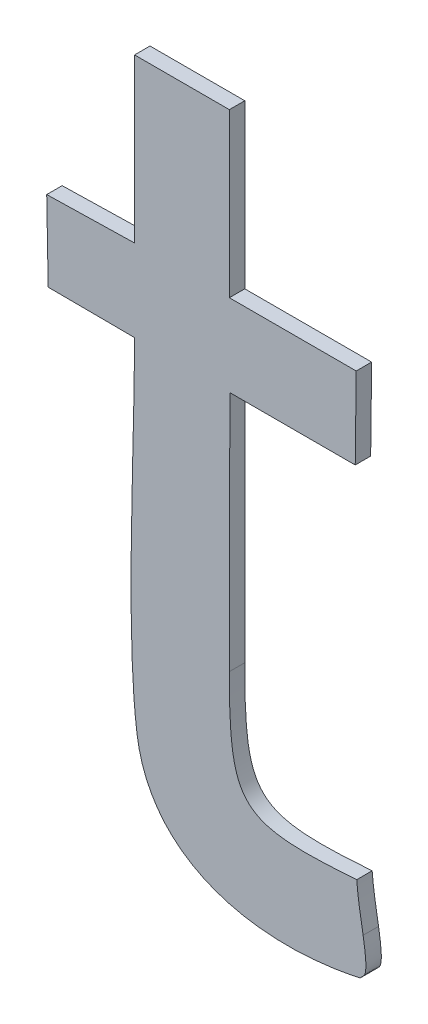
ISO-10303-21;
HEADER;
FILE_DESCRIPTION(('STEP AP214'),'2;1');
FILE_NAME('part.step','',(''),(''),'','','');
FILE_SCHEMA(('AUTOMOTIVE_DESIGN { 1 0 10303 214 1 1 1 1 }'));
ENDSEC;
DATA;
#1=APPLICATION_CONTEXT('core data for automotive mechanical design processes');
#2=APPLICATION_PROTOCOL_DEFINITION('international standard','automotive_design',2000,#1);
#3=PRODUCT_CONTEXT('',#1,'mechanical');
#4=PRODUCT('Part','Part','',(#3));
#5=PRODUCT_RELATED_PRODUCT_CATEGORY('part','',(#4));
#6=PRODUCT_DEFINITION_FORMATION('','',#4);
#7=PRODUCT_DEFINITION_CONTEXT('part definition',#1,'design');
#8=PRODUCT_DEFINITION('design','',#6,#7);
#9=PRODUCT_DEFINITION_SHAPE('','',#8);
#10=(LENGTH_UNIT() NAMED_UNIT(*) SI_UNIT(.MILLI.,.METRE.));
#11=(NAMED_UNIT(*) PLANE_ANGLE_UNIT() SI_UNIT($,.RADIAN.));
#12=(NAMED_UNIT(*) SI_UNIT($,.STERADIAN.) SOLID_ANGLE_UNIT());
#13=UNCERTAINTY_MEASURE_WITH_UNIT(LENGTH_MEASURE(1.E-05),#10,'distance_accuracy_value','');
#14=(GEOMETRIC_REPRESENTATION_CONTEXT(3) GLOBAL_UNCERTAINTY_ASSIGNED_CONTEXT((#13)) GLOBAL_UNIT_ASSIGNED_CONTEXT((#10,
#11,#12)) REPRESENTATION_CONTEXT('',''));
#15=CARTESIAN_POINT('',(0.,0.,0.));
#16=DIRECTION('',(0.,0.,1.));
#17=DIRECTION('',(1.,0.,0.));
#18=AXIS2_PLACEMENT_3D('',#15,#16,#17);
#19=CARTESIAN_POINT('',(-1.76600203125,-48.63324453125,0.001));
#20=CARTESIAN_POINT('',(-1.76600203125,-48.63324453125,0.));
#21=CARTESIAN_POINT('',(-1.773616171875,-48.6337883984375,0.001));
#22=CARTESIAN_POINT('',(-1.773616171875,-48.6337883984375,0.));
#23=CARTESIAN_POINT('',(-1.774256015625,-48.633180546875,0.001));
#24=CARTESIAN_POINT('',(-1.774256015625,-48.633180546875,0.));
#25=CARTESIAN_POINT('',(-1.774256015625,-48.625694375,0.001));
#26=CARTESIAN_POINT('',(-1.774256015625,-48.625694375,0.));
#27=B_SPLINE_SURFACE_WITH_KNOTS('',3,1,((#19,#20),(#21,#22),(#23,#24),(#25,#26)),.UNSPECIFIED.,
.F.,.F.,.F.,(4,4),(2,2),(0.3125,0.375),(0.,1.),.UNSPECIFIED.);
#28=CARTESIAN_POINT('',(-1.76600203125,-48.63324453125,0.));
#29=CARTESIAN_POINT('',(-1.773616171875,-48.6337883984375,0.));
#30=CARTESIAN_POINT('',(-1.774256015625,-48.633180546875,0.));
#31=CARTESIAN_POINT('',(-1.774256015625,-48.625694375,0.));
#32=B_SPLINE_CURVE_WITH_KNOTS('',3,(#28,#29,#30,#31),.UNSPECIFIED.,.F.,.F.,(4,4),(0.3125,0.375),.UNSPECIFIED.);
#33=CARTESIAN_POINT('',(-1.76600203125,-48.63324453125,0.));
#34=VERTEX_POINT('',#33);
#35=CARTESIAN_POINT('',(-1.774256015625,-48.625694375,0.));
#36=VERTEX_POINT('',#35);
#37=EDGE_CURVE('E11',#34,#36,#32,.T.);
#38=DIRECTION('',(0.,0.,-1.));
#39=VECTOR('',#38,1.);
#40=CARTESIAN_POINT('',(-1.774256015625,-48.625694375,0.001));
#41=LINE('',#40,#39);
#42=CARTESIAN_POINT('',(-1.774256015625,-48.625694375,0.001));
#43=VERTEX_POINT('',#42);
#44=EDGE_CURVE('E28',#43,#36,#41,.T.);
#45=CARTESIAN_POINT('',(-1.76600203125,-48.63324453125,0.001));
#46=CARTESIAN_POINT('',(-1.773616171875,-48.6337883984375,0.001));
#47=CARTESIAN_POINT('',(-1.774256015625,-48.633180546875,0.001));
#48=CARTESIAN_POINT('',(-1.774256015625,-48.625694375,0.001));
#49=B_SPLINE_CURVE_WITH_KNOTS('',3,(#45,#46,#47,#48),.UNSPECIFIED.,.F.,.F.,(4,4),(0.3125,0.375),.UNSPECIFIED.);
#50=CARTESIAN_POINT('',(-1.76600203125,-48.63324453125,0.001));
#51=VERTEX_POINT('',#50);
#52=EDGE_CURVE('E294',#51,#43,#49,.T.);
#53=DIRECTION('',(0.,0.,-1.));
#54=VECTOR('',#53,1.);
#55=CARTESIAN_POINT('',(-1.76600203125,-48.63324453125,0.001));
#56=LINE('',#55,#54);
#57=EDGE_CURVE('E40',#51,#34,#56,.T.);
#58=ORIENTED_EDGE('',*,*,#37,.T.);
#59=ORIENTED_EDGE('',*,*,#44,.F.);
#60=ORIENTED_EDGE('',*,*,#52,.F.);
#61=ORIENTED_EDGE('',*,*,#57,.T.);
#62=EDGE_LOOP('',(#58,#59,#60,#61));
#63=FACE_BOUND('',#62,.T.);
#64=ADVANCED_FACE('F17',(#63),#27,.F.);
#65=CARTESIAN_POINT('',(-1.774256015625,-48.625694375,0.001));
#66=CARTESIAN_POINT('',(-1.774256015625,-48.625694375,0.));
#67=CARTESIAN_POINT('',(-1.7742240234375,-48.6204796484375,0.001));
#68=CARTESIAN_POINT('',(-1.7742240234375,-48.6204796484375,0.));
#69=CARTESIAN_POINT('',(-1.774256015625,-48.615264921875,0.001));
#70=CARTESIAN_POINT('',(-1.774256015625,-48.615264921875,0.));
#71=CARTESIAN_POINT('',(-1.7742240234375,-48.610018203125,0.001));
#72=CARTESIAN_POINT('',(-1.7742240234375,-48.610018203125,0.));
#73=B_SPLINE_SURFACE_WITH_KNOTS('',3,1,((#65,#66),(#67,#68),(#69,#70),(#71,#72)),.UNSPECIFIED.,
.F.,.F.,.F.,(4,4),(2,2),(0.375,0.4375),(0.,1.),.UNSPECIFIED.);
#74=CARTESIAN_POINT('',(-1.774256015625,-48.625694375,0.));
#75=CARTESIAN_POINT('',(-1.7742240234375,-48.6204796484375,0.));
#76=CARTESIAN_POINT('',(-1.774256015625,-48.615264921875,0.));
#77=CARTESIAN_POINT('',(-1.7742240234375,-48.610018203125,0.));
#78=B_SPLINE_CURVE_WITH_KNOTS('',3,(#74,#75,#76,#77),.UNSPECIFIED.,.F.,.F.,(4,4),(0.375,0.4375),.UNSPECIFIED.);
#79=CARTESIAN_POINT('',(-1.7742240234375,-48.610018203125,0.));
#80=VERTEX_POINT('',#79);
#81=EDGE_CURVE('E286',#36,#80,#78,.T.);
#82=DIRECTION('',(0.,0.,-1.));
#83=VECTOR('',#82,1.);
#84=CARTESIAN_POINT('',(-1.7742240234375,-48.610018203125,0.001));
#85=LINE('',#84,#83);
#86=CARTESIAN_POINT('',(-1.7742240234375,-48.610018203125,0.001));
#87=VERTEX_POINT('',#86);
#88=EDGE_CURVE('E281',#87,#80,#85,.T.);
#89=CARTESIAN_POINT('',(-1.774256015625,-48.625694375,0.001));
#90=CARTESIAN_POINT('',(-1.7742240234375,-48.6204796484375,0.001));
#91=CARTESIAN_POINT('',(-1.774256015625,-48.615264921875,0.001));
#92=CARTESIAN_POINT('',(-1.7742240234375,-48.610018203125,0.001));
#93=B_SPLINE_CURVE_WITH_KNOTS('',3,(#89,#90,#91,#92),.UNSPECIFIED.,.F.,.F.,(4,4),(0.375,0.4375),.UNSPECIFIED.);
#94=EDGE_CURVE('E277',#43,#87,#93,.T.);
#95=ORIENTED_EDGE('',*,*,#81,.T.);
#96=ORIENTED_EDGE('',*,*,#88,.F.);
#97=ORIENTED_EDGE('',*,*,#94,.F.);
#98=ORIENTED_EDGE('',*,*,#44,.T.);
#99=EDGE_LOOP('',(#95,#96,#97,#98));
#100=FACE_BOUND('',#99,.T.);
#101=ADVANCED_FACE('F302',(#100),#73,.F.);
#102=CARTESIAN_POINT('',(0.,-48.610018203125,0.001));
#103=DIRECTION('',(0.,1.,0.));
#104=DIRECTION('',(0.,0.,1.));
#105=AXIS2_PLACEMENT_3D('',#102,#103,#104);
#106=PLANE('',#105);
#107=DIRECTION('',(1.,0.,0.));
#108=VECTOR('',#107,1.);
#109=CARTESIAN_POINT('',(0.,-48.610018203125,0.));
#110=LINE('',#109,#108);
#111=CARTESIAN_POINT('',(-1.7660980078125,-48.610018203125,0.));
#112=VERTEX_POINT('',#111);
#113=EDGE_CURVE('E275',#80,#112,#110,.T.);
#114=ORIENTED_EDGE('',*,*,#113,.T.);
#115=DIRECTION('',(0.,0.,-1.));
#116=VECTOR('',#115,1.);
#117=CARTESIAN_POINT('',(-1.7660980078125,-48.610018203125,0.001));
#118=LINE('',#117,#116);
#119=CARTESIAN_POINT('',(-1.7660980078125,-48.610018203125,0.001));
#120=VERTEX_POINT('',#119);
#121=EDGE_CURVE('E272',#120,#112,#118,.T.);
#122=ORIENTED_EDGE('',*,*,#121,.F.);
#123=DIRECTION('',(1.,0.,0.));
#124=VECTOR('',#123,1.);
#125=CARTESIAN_POINT('',(0.,-48.610018203125,0.001));
#126=LINE('',#125,#124);
#127=EDGE_CURVE('E269',#87,#120,#126,.T.);
#128=ORIENTED_EDGE('',*,*,#127,.F.);
#129=ORIENTED_EDGE('',*,*,#88,.T.);
#130=EDGE_LOOP('',(#114,#122,#128,#129));
#131=FACE_BOUND('',#130,.T.);
#132=ADVANCED_FACE('F306',(#131),#106,.F.);
#133=CARTESIAN_POINT('',(-1.1802638120411,0.0142200459281983,0.001));
#134=DIRECTION('',(-0.99992742842619,0.012047318414767,0.));
#135=DIRECTION('',(-0.012047318414767,-0.99992742842619,0.));
#136=AXIS2_PLACEMENT_3D('',#133,#134,#135);
#137=PLANE('',#136);
#138=DIRECTION('',(0.012047318414767,0.99992742842619,0.));
#139=VECTOR('',#138,1.);
#140=CARTESIAN_POINT('',(-1.1802638120411,0.0142200459281983,0.));
#141=LINE('',#140,#139);
#142=CARTESIAN_POINT('',(-1.7660340234375,-48.6047075,0.));
#143=VERTEX_POINT('',#142);
#144=EDGE_CURVE('E267',#112,#143,#141,.T.);
#145=ORIENTED_EDGE('',*,*,#144,.T.);
#146=DIRECTION('',(0.,0.,-1.));
#147=VECTOR('',#146,1.);
#148=CARTESIAN_POINT('',(-1.7660340234375,-48.6047075,0.001));
#149=LINE('',#148,#147);
#150=CARTESIAN_POINT('',(-1.7660340234375,-48.6047075,0.001));
#151=VERTEX_POINT('',#150);
#152=EDGE_CURVE('E264',#151,#143,#149,.T.);
#153=ORIENTED_EDGE('',*,*,#152,.F.);
#154=DIRECTION('',(0.012047318414767,0.99992742842619,0.));
#155=VECTOR('',#154,1.);
#156=CARTESIAN_POINT('',(-1.1802638120411,0.0142200459281983,0.001));
#157=LINE('',#156,#155);
#158=EDGE_CURVE('E261',#120,#151,#157,.T.);
#159=ORIENTED_EDGE('',*,*,#158,.F.);
#160=ORIENTED_EDGE('',*,*,#121,.T.);
#161=EDGE_LOOP('',(#145,#153,#159,#160));
#162=FACE_BOUND('',#161,.T.);
#163=ADVANCED_FACE('F310',(#162),#137,.F.);
#164=CARTESIAN_POINT('',(0.,-48.6047075,0.001));
#165=DIRECTION('',(0.,-1.,0.));
#166=DIRECTION('',(0.,0.,-1.));
#167=AXIS2_PLACEMENT_3D('',#164,#165,#166);
#168=PLANE('',#167);
#169=DIRECTION('',(-1.,0.,0.));
#170=VECTOR('',#169,1.);
#171=CARTESIAN_POINT('',(0.,-48.6047075,0.));
#172=LINE('',#171,#170);
#173=CARTESIAN_POINT('',(-1.774256015625,-48.6047075,0.));
#174=VERTEX_POINT('',#173);
#175=EDGE_CURVE('E259',#143,#174,#172,.T.);
#176=ORIENTED_EDGE('',*,*,#175,.T.);
#177=DIRECTION('',(0.,0.,-1.));
#178=VECTOR('',#177,1.);
#179=CARTESIAN_POINT('',(-1.774256015625,-48.6047075,0.001));
#180=LINE('',#179,#178);
#181=CARTESIAN_POINT('',(-1.774256015625,-48.6047075,0.001));
#182=VERTEX_POINT('',#181);
#183=EDGE_CURVE('E256',#182,#174,#180,.T.);
#184=ORIENTED_EDGE('',*,*,#183,.F.);
#185=DIRECTION('',(-1.,0.,0.));
#186=VECTOR('',#185,1.);
#187=CARTESIAN_POINT('',(0.,-48.6047075,0.001));
#188=LINE('',#187,#186);
#189=EDGE_CURVE('E253',#151,#182,#188,.T.);
#190=ORIENTED_EDGE('',*,*,#189,.F.);
#191=ORIENTED_EDGE('',*,*,#152,.T.);
#192=EDGE_LOOP('',(#176,#184,#190,#191));
#193=FACE_BOUND('',#192,.T.);
#194=ADVANCED_FACE('F314',(#193),#168,.F.);
#195=CARTESIAN_POINT('',(-1.774256015625,0.,0.001));
#196=DIRECTION('',(-1.,0.,0.));
#197=DIRECTION('',(0.,0.,1.));
#198=AXIS2_PLACEMENT_3D('',#195,#196,#197);
#199=PLANE('',#198);
#200=DIRECTION('',(0.,1.,0.));
#201=VECTOR('',#200,1.);
#202=CARTESIAN_POINT('',(-1.774256015625,0.,0.));
#203=LINE('',#202,#201);
#204=CARTESIAN_POINT('',(-1.774256015625,-48.594150078125,0.));
#205=VERTEX_POINT('',#204);
#206=EDGE_CURVE('E251',#174,#205,#203,.T.);
#207=ORIENTED_EDGE('',*,*,#206,.T.);
#208=DIRECTION('',(0.,0.,-1.));
#209=VECTOR('',#208,1.);
#210=CARTESIAN_POINT('',(-1.774256015625,-48.594150078125,0.001));
#211=LINE('',#210,#209);
#212=CARTESIAN_POINT('',(-1.774256015625,-48.594150078125,0.001));
#213=VERTEX_POINT('',#212);
#214=EDGE_CURVE('E248',#213,#205,#211,.T.);
#215=ORIENTED_EDGE('',*,*,#214,.F.);
#216=DIRECTION('',(0.,1.,0.));
#217=VECTOR('',#216,1.);
#218=CARTESIAN_POINT('',(-1.774256015625,0.,0.001));
#219=LINE('',#218,#217);
#220=EDGE_CURVE('E245',#182,#213,#219,.T.);
#221=ORIENTED_EDGE('',*,*,#220,.F.);
#222=ORIENTED_EDGE('',*,*,#183,.T.);
#223=EDGE_LOOP('',(#207,#215,#221,#222));
#224=FACE_BOUND('',#223,.T.);
#225=ADVANCED_FACE('F321',(#224),#199,.F.);
#226=CARTESIAN_POINT('',(0.,-48.594150078125,0.001));
#227=DIRECTION('',(0.,-1.,0.));
#228=DIRECTION('',(0.,0.,-1.));
#229=AXIS2_PLACEMENT_3D('',#226,#227,#228);
#230=PLANE('',#229);
#231=DIRECTION('',(-1.,0.,0.));
#232=VECTOR('',#231,1.);
#233=CARTESIAN_POINT('',(0.,-48.594150078125,0.));
#234=LINE('',#233,#232);
#235=CARTESIAN_POINT('',(-1.780398515625,-48.594150078125,0.));
#236=VERTEX_POINT('',#235);
#237=EDGE_CURVE('E243',#205,#236,#234,.T.);
#238=ORIENTED_EDGE('',*,*,#237,.T.);
#239=DIRECTION('',(0.,0.,-1.));
#240=VECTOR('',#239,1.);
#241=CARTESIAN_POINT('',(-1.780398515625,-48.594150078125,0.001));
#242=LINE('',#241,#240);
#243=CARTESIAN_POINT('',(-1.780398515625,-48.594150078125,0.001));
#244=VERTEX_POINT('',#243);
#245=EDGE_CURVE('E240',#244,#236,#242,.T.);
#246=ORIENTED_EDGE('',*,*,#245,.F.);
#247=DIRECTION('',(-1.,0.,0.));
#248=VECTOR('',#247,1.);
#249=CARTESIAN_POINT('',(0.,-48.594150078125,0.001));
#250=LINE('',#249,#248);
#251=EDGE_CURVE('E237',#213,#244,#250,.T.);
#252=ORIENTED_EDGE('',*,*,#251,.F.);
#253=ORIENTED_EDGE('',*,*,#214,.T.);
#254=EDGE_LOOP('',(#238,#246,#252,#253));
#255=FACE_BOUND('',#254,.T.);
#256=ADVANCED_FACE('F325',(#255),#230,.F.);
#257=CARTESIAN_POINT('',(-1.780398515625,0.,0.001));
#258=DIRECTION('',(1.,0.,0.));
#259=DIRECTION('',(0.,0.,-1.));
#260=AXIS2_PLACEMENT_3D('',#257,#258,#259);
#261=PLANE('',#260);
#262=DIRECTION('',(0.,-1.,0.));
#263=VECTOR('',#262,1.);
#264=CARTESIAN_POINT('',(-1.780398515625,0.,0.));
#265=LINE('',#264,#263);
#266=CARTESIAN_POINT('',(-1.780398515625,-48.6047075,0.));
#267=VERTEX_POINT('',#266);
#268=EDGE_CURVE('E235',#236,#267,#265,.T.);
#269=ORIENTED_EDGE('',*,*,#268,.T.);
#270=DIRECTION('',(0.,0.,-1.));
#271=VECTOR('',#270,1.);
#272=CARTESIAN_POINT('',(-1.780398515625,-48.6047075,0.001));
#273=LINE('',#272,#271);
#274=CARTESIAN_POINT('',(-1.780398515625,-48.6047075,0.001));
#275=VERTEX_POINT('',#274);
#276=EDGE_CURVE('E232',#275,#267,#273,.T.);
#277=ORIENTED_EDGE('',*,*,#276,.F.);
#278=DIRECTION('',(0.,-1.,0.));
#279=VECTOR('',#278,1.);
#280=CARTESIAN_POINT('',(-1.780398515625,0.,0.001));
#281=LINE('',#280,#279);
#282=EDGE_CURVE('E229',#244,#275,#281,.T.);
#283=ORIENTED_EDGE('',*,*,#282,.F.);
#284=ORIENTED_EDGE('',*,*,#245,.T.);
#285=EDGE_LOOP('',(#269,#277,#283,#284));
#286=FACE_BOUND('',#285,.T.);
#287=ADVANCED_FACE('F329',(#286),#261,.F.);
#288=CARTESIAN_POINT('',(1.0907907054763,-48.5401863939081,0.001));
#289=DIRECTION('',(0.0224662382519717,-0.999747602217082,0.));
#290=DIRECTION('',(0.999747602217082,0.0224662382519717,0.));
#291=AXIS2_PLACEMENT_3D('',#288,#289,#290);
#292=PLANE('',#291);
#293=DIRECTION('',(-0.999747602217082,-0.0224662382519717,0.));
#294=VECTOR('',#293,1.);
#295=CARTESIAN_POINT('',(1.0907907054763,-48.5401863939081,0.));
#296=LINE('',#295,#294);
#297=CARTESIAN_POINT('',(-1.786093125,-48.60483546875,0.));
#298=VERTEX_POINT('',#297);
#299=EDGE_CURVE('E227',#267,#298,#296,.T.);
#300=ORIENTED_EDGE('',*,*,#299,.T.);
#301=DIRECTION('',(0.,0.,-1.));
#302=VECTOR('',#301,1.);
#303=CARTESIAN_POINT('',(-1.786093125,-48.60483546875,0.001));
#304=LINE('',#303,#302);
#305=CARTESIAN_POINT('',(-1.786093125,-48.60483546875,0.001));
#306=VERTEX_POINT('',#305);
#307=EDGE_CURVE('E224',#306,#298,#304,.T.);
#308=ORIENTED_EDGE('',*,*,#307,.F.);
#309=DIRECTION('',(-0.999747602217082,-0.0224662382519717,0.));
#310=VECTOR('',#309,1.);
#311=CARTESIAN_POINT('',(1.0907907054763,-48.5401863939081,0.001));
#312=LINE('',#311,#310);
#313=EDGE_CURVE('E221',#275,#306,#312,.T.);
#314=ORIENTED_EDGE('',*,*,#313,.F.);
#315=ORIENTED_EDGE('',*,*,#276,.T.);
#316=EDGE_LOOP('',(#300,#308,#314,#315));
#317=FACE_BOUND('',#316,.T.);
#318=ADVANCED_FACE('F332',(#317),#292,.F.);
#319=CARTESIAN_POINT('',(-2.6908390059533,-0.0501398572534376,0.001));
#320=DIRECTION('',(0.999826440781255,0.0186303063498313,0.));
#321=DIRECTION('',(-0.0186303063498313,0.999826440781255,0.));
#322=AXIS2_PLACEMENT_3D('',#319,#320,#321);
#323=PLANE('',#322);
#324=DIRECTION('',(0.0186303063498313,-0.999826440781254,0.));
#325=VECTOR('',#324,1.);
#326=CARTESIAN_POINT('',(-2.6908390059533,-0.0501398572534376,0.));
#327=LINE('',#326,#325);
#328=CARTESIAN_POINT('',(-1.7859971484375,-48.6099862109375,0.));
#329=VERTEX_POINT('',#328);
#330=EDGE_CURVE('E219',#298,#329,#327,.T.);
#331=ORIENTED_EDGE('',*,*,#330,.T.);
#332=DIRECTION('',(0.,0.,-1.));
#333=VECTOR('',#332,1.);
#334=CARTESIAN_POINT('',(-1.7859971484375,-48.6099862109375,0.001));
#335=LINE('',#334,#333);
#336=CARTESIAN_POINT('',(-1.7859971484375,-48.6099862109375,0.001));
#337=VERTEX_POINT('',#336);
#338=EDGE_CURVE('E216',#337,#329,#335,.T.);
#339=ORIENTED_EDGE('',*,*,#338,.F.);
#340=DIRECTION('',(0.0186303063498313,-0.999826440781254,0.));
#341=VECTOR('',#340,1.);
#342=CARTESIAN_POINT('',(-2.6908390059533,-0.0501398572534376,0.001));
#343=LINE('',#342,#341);
#344=EDGE_CURVE('E213',#306,#337,#343,.T.);
#345=ORIENTED_EDGE('',*,*,#344,.F.);
#346=ORIENTED_EDGE('',*,*,#307,.T.);
#347=EDGE_LOOP('',(#331,#339,#345,#346));
#348=FACE_BOUND('',#347,.T.);
#349=ADVANCED_FACE('F337',(#348),#323,.F.);
#350=CARTESIAN_POINT('',(-0.277820596326707,-48.6186043626629,0.001));
#351=DIRECTION('',(0.0057141924214647,0.999983673869214,0.));
#352=DIRECTION('',(-0.999983673869214,0.0057141924214647,0.));
#353=AXIS2_PLACEMENT_3D('',#350,#351,#352);
#354=PLANE('',#353);
#355=DIRECTION('',(0.999983673869214,-0.0057141924214647,0.));
#356=VECTOR('',#355,1.);
#357=CARTESIAN_POINT('',(-0.277820596326707,-48.6186043626629,0.));
#358=LINE('',#357,#356);
#359=CARTESIAN_POINT('',(-1.780398515625,-48.610018203125,0.));
#360=VERTEX_POINT('',#359);
#361=EDGE_CURVE('E211',#329,#360,#358,.T.);
#362=ORIENTED_EDGE('',*,*,#361,.T.);
#363=DIRECTION('',(0.,0.,-1.));
#364=VECTOR('',#363,1.);
#365=CARTESIAN_POINT('',(-1.780398515625,-48.610018203125,0.001));
#366=LINE('',#365,#364);
#367=CARTESIAN_POINT('',(-1.780398515625,-48.610018203125,0.001));
#368=VERTEX_POINT('',#367);
#369=EDGE_CURVE('E208',#368,#360,#366,.T.);
#370=ORIENTED_EDGE('',*,*,#369,.F.);
#371=DIRECTION('',(0.999983673869214,-0.0057141924214647,0.));
#372=VECTOR('',#371,1.);
#373=CARTESIAN_POINT('',(-0.277820596326707,-48.6186043626629,0.001));
#374=LINE('',#373,#372);
#375=EDGE_CURVE('E202',#337,#368,#374,.T.);
#376=ORIENTED_EDGE('',*,*,#375,.F.);
#377=ORIENTED_EDGE('',*,*,#338,.T.);
#378=EDGE_LOOP('',(#362,#370,#376,#377));
#379=FACE_BOUND('',#378,.T.);
#380=ADVANCED_FACE('F341',(#379),#354,.F.);
#381=CARTESIAN_POINT('',(-1.780398515625,-48.610018203125,0.001));
#382=CARTESIAN_POINT('',(-1.780398515625,-48.610018203125,0.));
#383=CARTESIAN_POINT('',(-1.780398515625,-48.61609671875,0.001));
#384=CARTESIAN_POINT('',(-1.780398515625,-48.61609671875,0.));
#385=CARTESIAN_POINT('',(-1.7810063671875,-48.6266221484375,0.001));
#386=CARTESIAN_POINT('',(-1.7810063671875,-48.6266221484375,0.));
#387=CARTESIAN_POINT('',(-1.7802385546875,-48.6321887890625,0.001));
#388=CARTESIAN_POINT('',(-1.7802385546875,-48.6321887890625,0.));
#389=B_SPLINE_SURFACE_WITH_KNOTS('',3,1,((#381,#382),(#383,#384),(#385,#386),(#387,#388)),
.UNSPECIFIED.,.F.,.F.,.F.,(4,4),(2,2),(0.0625,0.125),(0.,1.),.UNSPECIFIED.);
#390=CARTESIAN_POINT('',(-1.780398515625,-48.610018203125,0.));
#391=CARTESIAN_POINT('',(-1.780398515625,-48.61609671875,0.));
#392=CARTESIAN_POINT('',(-1.7810063671875,-48.6266221484375,0.));
#393=CARTESIAN_POINT('',(-1.7802385546875,-48.6321887890625,0.));
#394=B_SPLINE_CURVE_WITH_KNOTS('',3,(#390,#391,#392,#393),.UNSPECIFIED.,.F.,.F.,(4,4),(0.0625,
0.125),.UNSPECIFIED.);
#395=CARTESIAN_POINT('',(-1.7802385546875,-48.6321887890625,0.));
#396=VERTEX_POINT('',#395);
#397=EDGE_CURVE('E197',#360,#396,#394,.T.);
#398=DIRECTION('',(0.,0.,-1.));
#399=VECTOR('',#398,1.);
#400=CARTESIAN_POINT('',(-1.7802385546875,-48.6321887890625,0.001));
#401=LINE('',#400,#399);
#402=CARTESIAN_POINT('',(-1.7802385546875,-48.6321887890625,0.001));
#403=VERTEX_POINT('',#402);
#404=EDGE_CURVE('E192',#403,#396,#401,.T.);
#405=CARTESIAN_POINT('',(-1.780398515625,-48.610018203125,0.001));
#406=CARTESIAN_POINT('',(-1.780398515625,-48.61609671875,0.001));
#407=CARTESIAN_POINT('',(-1.7810063671875,-48.6266221484375,0.001));
#408=CARTESIAN_POINT('',(-1.7802385546875,-48.6321887890625,0.001));
#409=B_SPLINE_CURVE_WITH_KNOTS('',3,(#405,#406,#407,#408),.UNSPECIFIED.,.F.,.F.,(4,4),(0.0625,
0.125),.UNSPECIFIED.);
#410=EDGE_CURVE('E185',#368,#403,#409,.T.);
#411=ORIENTED_EDGE('',*,*,#397,.T.);
#412=ORIENTED_EDGE('',*,*,#404,.F.);
#413=ORIENTED_EDGE('',*,*,#410,.F.);
#414=ORIENTED_EDGE('',*,*,#369,.T.);
#415=EDGE_LOOP('',(#411,#412,#413,#414));
#416=FACE_BOUND('',#415,.T.);
#417=ADVANCED_FACE('F345',(#416),#389,.F.);
#418=CARTESIAN_POINT('',(-1.7802385546875,-48.6321887890625,0.001));
#419=CARTESIAN_POINT('',(-1.7802385546875,-48.6321887890625,0.));
#420=CARTESIAN_POINT('',(-1.7793427734375,-48.638683203125,0.001));
#421=CARTESIAN_POINT('',(-1.7793427734375,-48.638683203125,0.));
#422=CARTESIAN_POINT('',(-1.7725604296875,-48.64015484375,0.001));
#423=CARTESIAN_POINT('',(-1.7725604296875,-48.64015484375,0.));
#424=CARTESIAN_POINT('',(-1.7657780859375,-48.6386512109375,0.001));
#425=CARTESIAN_POINT('',(-1.7657780859375,-48.6386512109375,0.));
#426=B_SPLINE_SURFACE_WITH_KNOTS('',3,1,((#418,#419),(#420,#421),(#422,#423),(#424,#425)),
.UNSPECIFIED.,.F.,.F.,.F.,(4,4),(2,2),(0.125,0.1875),(0.,1.),.UNSPECIFIED.);
#427=CARTESIAN_POINT('',(-1.7802385546875,-48.6321887890625,0.));
#428=CARTESIAN_POINT('',(-1.7793427734375,-48.638683203125,0.));
#429=CARTESIAN_POINT('',(-1.7725604296875,-48.64015484375,0.));
#430=CARTESIAN_POINT('',(-1.7657780859375,-48.6386512109375,0.));
#431=B_SPLINE_CURVE_WITH_KNOTS('',3,(#427,#428,#429,#430),.UNSPECIFIED.,.F.,.F.,(4,4),(0.125,
0.1875),.UNSPECIFIED.);
#432=CARTESIAN_POINT('',(-1.7657780859375,-48.6386512109375,0.));
#433=VERTEX_POINT('',#432);
#434=EDGE_CURVE('E180',#396,#433,#431,.T.);
#435=DIRECTION('',(0.,0.,-1.));
#436=VECTOR('',#435,1.);
#437=CARTESIAN_POINT('',(-1.7657780859375,-48.6386512109375,0.001));
#438=LINE('',#437,#436);
#439=CARTESIAN_POINT('',(-1.7657780859375,-48.6386512109375,0.001));
#440=VERTEX_POINT('',#439);
#441=EDGE_CURVE('E175',#440,#433,#438,.T.);
#442=CARTESIAN_POINT('',(-1.7802385546875,-48.6321887890625,0.001));
#443=CARTESIAN_POINT('',(-1.7793427734375,-48.638683203125,0.001));
#444=CARTESIAN_POINT('',(-1.7725604296875,-48.64015484375,0.001));
#445=CARTESIAN_POINT('',(-1.7657780859375,-48.6386512109375,0.001));
#446=B_SPLINE_CURVE_WITH_KNOTS('',3,(#442,#443,#444,#445),.UNSPECIFIED.,.F.,.F.,(4,4),(0.125,
0.1875),.UNSPECIFIED.);
#447=EDGE_CURVE('E133',#403,#440,#446,.T.);
#448=ORIENTED_EDGE('',*,*,#434,.T.);
#449=ORIENTED_EDGE('',*,*,#441,.F.);
#450=ORIENTED_EDGE('',*,*,#447,.F.);
#451=ORIENTED_EDGE('',*,*,#404,.T.);
#452=EDGE_LOOP('',(#448,#449,#450,#451));
#453=FACE_BOUND('',#452,.T.);
#454=ADVANCED_FACE('F348',(#453),#426,.F.);
#455=CARTESIAN_POINT('',(-1.7657780859375,-48.6386512109375,0.001));
#456=CARTESIAN_POINT('',(-1.7657780859375,-48.6386512109375,0.));
#457=CARTESIAN_POINT('',(-1.7655861328125,-48.6383312890625,0.001));
#458=CARTESIAN_POINT('',(-1.7655861328125,-48.6383312890625,0.));
#459=CARTESIAN_POINT('',(-1.765170234375,-48.6386512109375,0.001));
#460=CARTESIAN_POINT('',(-1.765170234375,-48.6386512109375,0.));
#461=CARTESIAN_POINT('',(-1.7655861328125,-48.6361558203125,0.001));
#462=CARTESIAN_POINT('',(-1.7655861328125,-48.6361558203125,0.));
#463=B_SPLINE_SURFACE_WITH_KNOTS('',3,1,((#455,#456),(#457,#458),(#459,#460),(#461,#462)),
.UNSPECIFIED.,.F.,.F.,.F.,(4,4),(2,2),(0.1875,0.25),(0.,1.),.UNSPECIFIED.);
#464=CARTESIAN_POINT('',(-1.7657780859375,-48.6386512109375,0.));
#465=CARTESIAN_POINT('',(-1.7655861328125,-48.6383312890625,0.));
#466=CARTESIAN_POINT('',(-1.765170234375,-48.6386512109375,0.));
#467=CARTESIAN_POINT('',(-1.7655861328125,-48.6361558203125,0.));
#468=B_SPLINE_CURVE_WITH_KNOTS('',3,(#464,#465,#466,#467),.UNSPECIFIED.,.F.,.F.,(4,4),(0.1875,
0.25),.UNSPECIFIED.);
#469=CARTESIAN_POINT('',(-1.7655861328125,-48.6361558203125,0.));
#470=VERTEX_POINT('',#469);
#471=EDGE_CURVE('E142',#433,#470,#468,.T.);
#472=DIRECTION('',(0.,0.,-1.));
#473=VECTOR('',#472,1.);
#474=CARTESIAN_POINT('',(-1.7655861328125,-48.6361558203125,0.001));
#475=LINE('',#474,#473);
#476=CARTESIAN_POINT('',(-1.7655861328125,-48.6361558203125,0.001));
#477=VERTEX_POINT('',#476);
#478=EDGE_CURVE('E136',#477,#470,#475,.T.);
#479=CARTESIAN_POINT('',(-1.7657780859375,-48.6386512109375,0.001));
#480=CARTESIAN_POINT('',(-1.7655861328125,-48.6383312890625,0.001));
#481=CARTESIAN_POINT('',(-1.765170234375,-48.6386512109375,0.001));
#482=CARTESIAN_POINT('',(-1.7655861328125,-48.6361558203125,0.001));
#483=B_SPLINE_CURVE_WITH_KNOTS('',3,(#479,#480,#481,#482),.UNSPECIFIED.,.F.,.F.,(4,4),(0.1875,
0.25),.UNSPECIFIED.);
#484=EDGE_CURVE('E127',#440,#477,#483,.T.);
#485=ORIENTED_EDGE('',*,*,#471,.T.);
#486=ORIENTED_EDGE('',*,*,#478,.F.);
#487=ORIENTED_EDGE('',*,*,#484,.F.);
#488=ORIENTED_EDGE('',*,*,#441,.T.);
#489=EDGE_LOOP('',(#485,#486,#487,#488));
#490=FACE_BOUND('',#489,.T.);
#491=ADVANCED_FACE('F140',(#490),#463,.F.);
#492=CARTESIAN_POINT('',(-1.7655861328125,-48.6361558203125,0.001));
#493=CARTESIAN_POINT('',(-1.7655861328125,-48.6361558203125,0.));
#494=CARTESIAN_POINT('',(-1.7657780859375,-48.63503609375,0.001));
#495=CARTESIAN_POINT('',(-1.7657780859375,-48.63503609375,0.));
#496=CARTESIAN_POINT('',(-1.7659060546875,-48.634332265625,0.001));
#497=CARTESIAN_POINT('',(-1.7659060546875,-48.634332265625,0.));
#498=CARTESIAN_POINT('',(-1.76600203125,-48.63324453125,0.001));
#499=CARTESIAN_POINT('',(-1.76600203125,-48.63324453125,0.));
#500=B_SPLINE_SURFACE_WITH_KNOTS('',3,1,((#492,#493),(#494,#495),(#496,#497),(#498,#499)),
.UNSPECIFIED.,.F.,.F.,.F.,(4,4),(2,2),(0.25,0.3125),(0.,1.),.UNSPECIFIED.);
#501=CARTESIAN_POINT('',(-1.7655861328125,-48.6361558203125,0.));
#502=CARTESIAN_POINT('',(-1.7657780859375,-48.63503609375,0.));
#503=CARTESIAN_POINT('',(-1.7659060546875,-48.634332265625,0.));
#504=CARTESIAN_POINT('',(-1.76600203125,-48.63324453125,0.));
#505=B_SPLINE_CURVE_WITH_KNOTS('',3,(#501,#502,#503,#504),.UNSPECIFIED.,.F.,.F.,(4,4),(0.25,
0.3125),.UNSPECIFIED.);
#506=EDGE_CURVE('E137',#470,#34,#505,.T.);
#507=CARTESIAN_POINT('',(-1.7655861328125,-48.6361558203125,0.001));
#508=CARTESIAN_POINT('',(-1.7657780859375,-48.63503609375,0.001));
#509=CARTESIAN_POINT('',(-1.7659060546875,-48.634332265625,0.001));
#510=CARTESIAN_POINT('',(-1.76600203125,-48.63324453125,0.001));
#511=B_SPLINE_CURVE_WITH_KNOTS('',3,(#507,#508,#509,#510),.UNSPECIFIED.,.F.,.F.,(4,4),(0.25,
0.3125),.UNSPECIFIED.);
#512=EDGE_CURVE('E131',#477,#51,#511,.T.);
#513=ORIENTED_EDGE('',*,*,#506,.T.);
#514=ORIENTED_EDGE('',*,*,#57,.F.);
#515=ORIENTED_EDGE('',*,*,#512,.F.);
#516=ORIENTED_EDGE('',*,*,#478,.T.);
#517=EDGE_LOOP('',(#513,#514,#515,#516));
#518=FACE_BOUND('',#517,.T.);
#519=ADVANCED_FACE('F147',(#518),#500,.F.);
#520=CARTESIAN_POINT('',(0.,0.,0.001));
#521=DIRECTION('',(0.,0.,1.));
#522=DIRECTION('',(1.,0.,0.));
#523=AXIS2_PLACEMENT_3D('',#520,#521,#522);
#524=PLANE('',#523);
#525=ORIENTED_EDGE('',*,*,#52,.T.);
#526=ORIENTED_EDGE('',*,*,#94,.T.);
#527=ORIENTED_EDGE('',*,*,#127,.T.);
#528=ORIENTED_EDGE('',*,*,#158,.T.);
#529=ORIENTED_EDGE('',*,*,#189,.T.);
#530=ORIENTED_EDGE('',*,*,#220,.T.);
#531=ORIENTED_EDGE('',*,*,#251,.T.);
#532=ORIENTED_EDGE('',*,*,#282,.T.);
#533=ORIENTED_EDGE('',*,*,#313,.T.);
#534=ORIENTED_EDGE('',*,*,#344,.T.);
#535=ORIENTED_EDGE('',*,*,#375,.T.);
#536=ORIENTED_EDGE('',*,*,#410,.T.);
#537=ORIENTED_EDGE('',*,*,#447,.T.);
#538=ORIENTED_EDGE('',*,*,#484,.T.);
#539=ORIENTED_EDGE('',*,*,#512,.T.);
#540=EDGE_LOOP('',(#525,#526,#527,#528,#529,#530,#531,#532,#533,#534,#535,#536,#537,#538,#539));
#541=FACE_BOUND('',#540,.T.);
#542=ADVANCED_FACE('F129',(#541),#524,.T.);
#543=CARTESIAN_POINT('',(0.,0.,0.));
#544=DIRECTION('',(0.,0.,1.));
#545=DIRECTION('',(1.,0.,0.));
#546=AXIS2_PLACEMENT_3D('',#543,#544,#545);
#547=PLANE('',#546);
#548=ORIENTED_EDGE('',*,*,#37,.F.);
#549=ORIENTED_EDGE('',*,*,#506,.F.);
#550=ORIENTED_EDGE('',*,*,#471,.F.);
#551=ORIENTED_EDGE('',*,*,#434,.F.);
#552=ORIENTED_EDGE('',*,*,#397,.F.);
#553=ORIENTED_EDGE('',*,*,#361,.F.);
#554=ORIENTED_EDGE('',*,*,#330,.F.);
#555=ORIENTED_EDGE('',*,*,#299,.F.);
#556=ORIENTED_EDGE('',*,*,#268,.F.);
#557=ORIENTED_EDGE('',*,*,#237,.F.);
#558=ORIENTED_EDGE('',*,*,#206,.F.);
#559=ORIENTED_EDGE('',*,*,#175,.F.);
#560=ORIENTED_EDGE('',*,*,#144,.F.);
#561=ORIENTED_EDGE('',*,*,#113,.F.);
#562=ORIENTED_EDGE('',*,*,#81,.F.);
#563=EDGE_LOOP('',(#548,#549,#550,#551,#552,#553,#554,#555,#556,#557,#558,#559,#560,#561,#562));
#564=FACE_BOUND('',#563,.T.);
#565=ADVANCED_FACE('F317',(#564),#547,.F.);
#566=CLOSED_SHELL('',(#64,#101,#132,#163,#194,#225,#256,#287,#318,#349,#380,#417,#454,#491,#519,
#542,#565));
#567=MANIFOLD_SOLID_BREP('B1',#566);
#568=ADVANCED_BREP_SHAPE_REPRESENTATION('',(#18,#567),#14);
#569=SHAPE_DEFINITION_REPRESENTATION(#9,#568);
ENDSEC;
END-ISO-10303-21;
